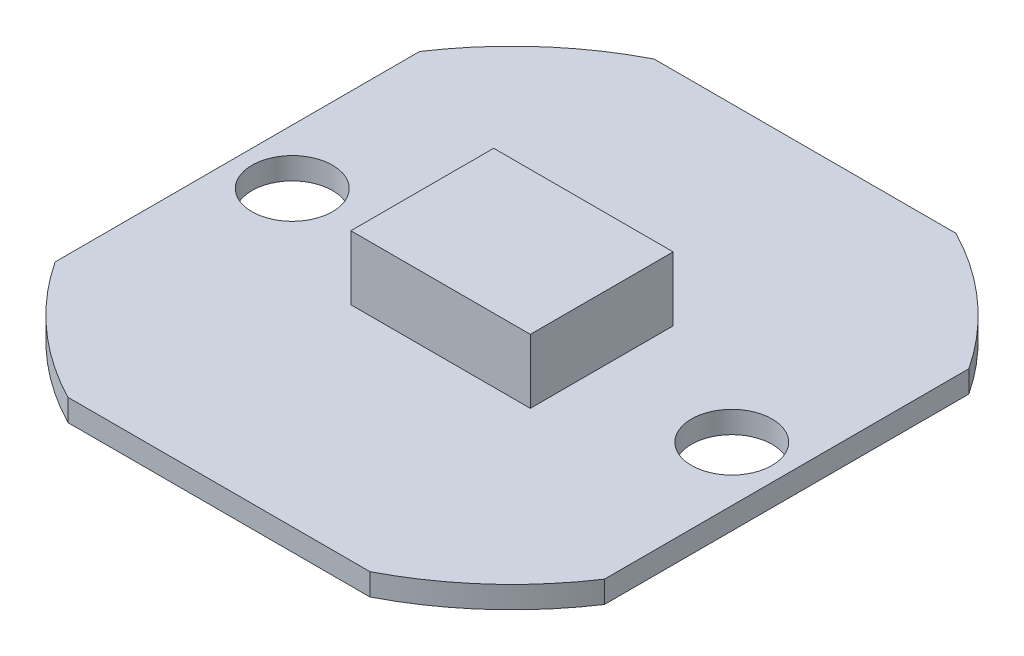
ISO-10303-21;
HEADER;
FILE_DESCRIPTION(('STEP AP214'),'2;1');
FILE_NAME('part.step','',(''),(''),'','','');
FILE_SCHEMA(('AUTOMOTIVE_DESIGN { 1 0 10303 214 1 1 1 1 }'));
ENDSEC;
DATA;
#1=APPLICATION_CONTEXT('core data for automotive mechanical design processes');
#2=APPLICATION_PROTOCOL_DEFINITION('international standard','automotive_design',2000,#1);
#3=PRODUCT_CONTEXT('',#1,'mechanical');
#4=PRODUCT('Part','Part','',(#3));
#5=PRODUCT_RELATED_PRODUCT_CATEGORY('part','',(#4));
#6=PRODUCT_DEFINITION_FORMATION('','',#4);
#7=PRODUCT_DEFINITION_CONTEXT('part definition',#1,'design');
#8=PRODUCT_DEFINITION('design','',#6,#7);
#9=PRODUCT_DEFINITION_SHAPE('','',#8);
#10=(LENGTH_UNIT() NAMED_UNIT(*) SI_UNIT(.MILLI.,.METRE.));
#11=(NAMED_UNIT(*) PLANE_ANGLE_UNIT() SI_UNIT($,.RADIAN.));
#12=(NAMED_UNIT(*) SI_UNIT($,.STERADIAN.) SOLID_ANGLE_UNIT());
#13=UNCERTAINTY_MEASURE_WITH_UNIT(LENGTH_MEASURE(1.E-05),#10,'distance_accuracy_value','');
#14=(GEOMETRIC_REPRESENTATION_CONTEXT(3) GLOBAL_UNCERTAINTY_ASSIGNED_CONTEXT((#13)) GLOBAL_UNIT_ASSIGNED_CONTEXT((#10,
#11,#12)) REPRESENTATION_CONTEXT('',''));
#15=CARTESIAN_POINT('',(0.,0.,0.));
#16=DIRECTION('',(0.,0.,1.));
#17=DIRECTION('',(1.,0.,0.));
#18=AXIS2_PLACEMENT_3D('',#15,#16,#17);
#19=CARTESIAN_POINT('',(0.,0.6,0.));
#20=DIRECTION('',(0.,-1.,0.));
#21=DIRECTION('',(0.,0.,-1.));
#22=AXIS2_PLACEMENT_3D('',#19,#20,#21);
#23=PLANE('',#22);
#24=CARTESIAN_POINT('',(6.,0.6,0.));
#25=DIRECTION('',(0.,1.,0.));
#26=DIRECTION('',(0.,0.,-1.));
#27=AXIS2_PLACEMENT_3D('',#24,#25,#26);
#28=CIRCLE('',#27,1.1);
#29=CARTESIAN_POINT('',(6.,0.6,-1.1));
#30=VERTEX_POINT('',#29);
#31=EDGE_CURVE('E157',#30,#30,#28,.T.);
#32=ORIENTED_EDGE('',*,*,#31,.F.);
#33=EDGE_LOOP('',(#32));
#34=FACE_BOUND('',#33,.T.);
#35=CARTESIAN_POINT('',(-6.,0.6,0.));
#36=DIRECTION('',(0.,1.,0.));
#37=DIRECTION('',(0.,0.,1.));
#38=AXIS2_PLACEMENT_3D('',#35,#36,#37);
#39=CIRCLE('',#38,1.1);
#40=CARTESIAN_POINT('',(-6.,0.6,1.1));
#41=VERTEX_POINT('',#40);
#42=EDGE_CURVE('E167',#41,#41,#39,.T.);
#43=ORIENTED_EDGE('',*,*,#42,.F.);
#44=EDGE_LOOP('',(#43));
#45=FACE_BOUND('',#44,.T.);
#46=CARTESIAN_POINT('',(0.,0.6,0.));
#47=DIRECTION('',(0.,1.,0.));
#48=DIRECTION('',(0.,0.,-1.));
#49=AXIS2_PLACEMENT_3D('',#46,#47,#48);
#50=CIRCLE('',#49,9.);
#51=CARTESIAN_POINT('',(-4.12310562561766,0.6,-8.));
#52=VERTEX_POINT('',#51);
#53=CARTESIAN_POINT('',(-7.5,0.6,-4.9749371855331));
#54=VERTEX_POINT('',#53);
#55=EDGE_CURVE('E175',#52,#54,#50,.T.);
#56=ORIENTED_EDGE('',*,*,#55,.T.);
#57=DIRECTION('',(0.,0.,1.));
#58=VECTOR('',#57,1.);
#59=CARTESIAN_POINT('',(-7.5,0.6,4.9749371855331));
#60=LINE('',#59,#58);
#61=CARTESIAN_POINT('',(-7.5,0.6,4.9749371855331));
#62=VERTEX_POINT('',#61);
#63=EDGE_CURVE('E179',#54,#62,#60,.T.);
#64=ORIENTED_EDGE('',*,*,#63,.T.);
#65=CARTESIAN_POINT('',(0.,0.6,0.));
#66=DIRECTION('',(0.,1.,0.));
#67=DIRECTION('',(0.,0.,1.));
#68=AXIS2_PLACEMENT_3D('',#65,#66,#67);
#69=CIRCLE('',#68,9.);
#70=CARTESIAN_POINT('',(-4.12310562561766,0.6,8.));
#71=VERTEX_POINT('',#70);
#72=EDGE_CURVE('E183',#62,#71,#69,.T.);
#73=ORIENTED_EDGE('',*,*,#72,.T.);
#74=DIRECTION('',(1.,0.,0.));
#75=VECTOR('',#74,1.);
#76=CARTESIAN_POINT('',(-4.12310562561766,0.6,8.));
#77=LINE('',#76,#75);
#78=CARTESIAN_POINT('',(4.12310562561766,0.6,8.));
#79=VERTEX_POINT('',#78);
#80=EDGE_CURVE('E186',#71,#79,#77,.T.);
#81=ORIENTED_EDGE('',*,*,#80,.T.);
#82=CARTESIAN_POINT('',(0.,0.6,0.));
#83=DIRECTION('',(0.,1.,0.));
#84=DIRECTION('',(0.,0.,-1.));
#85=AXIS2_PLACEMENT_3D('',#82,#83,#84);
#86=CIRCLE('',#85,9.);
#87=CARTESIAN_POINT('',(7.5,0.6,4.9749371855331));
#88=VERTEX_POINT('',#87);
#89=EDGE_CURVE('E189',#79,#88,#86,.T.);
#90=ORIENTED_EDGE('',*,*,#89,.T.);
#91=DIRECTION('',(0.,0.,-1.));
#92=VECTOR('',#91,1.);
#93=CARTESIAN_POINT('',(7.5,0.6,4.9749371855331));
#94=LINE('',#93,#92);
#95=CARTESIAN_POINT('',(7.5,0.6,-4.9749371855331));
#96=VERTEX_POINT('',#95);
#97=EDGE_CURVE('E192',#88,#96,#94,.T.);
#98=ORIENTED_EDGE('',*,*,#97,.T.);
#99=CARTESIAN_POINT('',(0.,0.6,0.));
#100=DIRECTION('',(0.,1.,0.));
#101=DIRECTION('',(0.,0.,1.));
#102=AXIS2_PLACEMENT_3D('',#99,#100,#101);
#103=CIRCLE('',#102,9.);
#104=CARTESIAN_POINT('',(4.12310562561766,0.6,-8.));
#105=VERTEX_POINT('',#104);
#106=EDGE_CURVE('E195',#96,#105,#103,.T.);
#107=ORIENTED_EDGE('',*,*,#106,.T.);
#108=DIRECTION('',(-1.,0.,0.));
#109=VECTOR('',#108,1.);
#110=CARTESIAN_POINT('',(-4.12310562561766,0.6,-8.));
#111=LINE('',#110,#109);
#112=EDGE_CURVE('E198',#105,#52,#111,.T.);
#113=ORIENTED_EDGE('',*,*,#112,.T.);
#114=EDGE_LOOP('',(#56,#64,#73,#81,#90,#98,#107,#113));
#115=FACE_BOUND('',#114,.T.);
#116=DIRECTION('',(0.,0.,1.));
#117=VECTOR('',#116,1.);
#118=CARTESIAN_POINT('',(-2.45,0.6,-1.95));
#119=LINE('',#118,#117);
#120=CARTESIAN_POINT('',(-2.45,0.6,-1.95));
#121=VERTEX_POINT('',#120);
#122=CARTESIAN_POINT('',(-2.45,0.6,1.95));
#123=VERTEX_POINT('',#122);
#124=EDGE_CURVE('E55',#121,#123,#119,.T.);
#125=ORIENTED_EDGE('',*,*,#124,.F.);
#126=DIRECTION('',(-1.,0.,0.));
#127=VECTOR('',#126,1.);
#128=CARTESIAN_POINT('',(2.45,0.6,-1.95));
#129=LINE('',#128,#127);
#130=CARTESIAN_POINT('',(2.45,0.6,-1.95));
#131=VERTEX_POINT('',#130);
#132=EDGE_CURVE('E59',#131,#121,#129,.T.);
#133=ORIENTED_EDGE('',*,*,#132,.F.);
#134=DIRECTION('',(0.,0.,-1.));
#135=VECTOR('',#134,1.);
#136=CARTESIAN_POINT('',(2.45,0.6,-1.95));
#137=LINE('',#136,#135);
#138=CARTESIAN_POINT('',(2.45,0.6,1.95));
#139=VERTEX_POINT('',#138);
#140=EDGE_CURVE('E444',#139,#131,#137,.T.);
#141=ORIENTED_EDGE('',*,*,#140,.F.);
#142=DIRECTION('',(1.,0.,0.));
#143=VECTOR('',#142,1.);
#144=CARTESIAN_POINT('',(-2.45,0.6,1.95));
#145=LINE('',#144,#143);
#146=EDGE_CURVE('E454',#123,#139,#145,.T.);
#147=ORIENTED_EDGE('',*,*,#146,.F.);
#148=EDGE_LOOP('',(#125,#133,#141,#147));
#149=FACE_BOUND('',#148,.T.);
#150=ADVANCED_FACE('F39',(#34,#45,#115,#149),#23,.F.);
#151=CARTESIAN_POINT('',(0.,0.,0.));
#152=DIRECTION('',(0.,-1.,0.));
#153=DIRECTION('',(0.,0.,-1.));
#154=AXIS2_PLACEMENT_3D('',#151,#152,#153);
#155=PLANE('',#154);
#156=CARTESIAN_POINT('',(-6.,0.,0.));
#157=DIRECTION('',(0.,1.,0.));
#158=DIRECTION('',(0.,0.,1.));
#159=AXIS2_PLACEMENT_3D('',#156,#157,#158);
#160=CIRCLE('',#159,1.1);
#161=CARTESIAN_POINT('',(-6.,0.,1.1));
#162=VERTEX_POINT('',#161);
#163=EDGE_CURVE('E165',#162,#162,#160,.T.);
#164=ORIENTED_EDGE('',*,*,#163,.T.);
#165=EDGE_LOOP('',(#164));
#166=FACE_BOUND('',#165,.T.);
#167=CARTESIAN_POINT('',(0.,0.,0.));
#168=DIRECTION('',(0.,1.,0.));
#169=DIRECTION('',(0.,0.,-1.));
#170=AXIS2_PLACEMENT_3D('',#167,#168,#169);
#171=CIRCLE('',#170,9.);
#172=CARTESIAN_POINT('',(-4.12310562561766,0.,-8.));
#173=VERTEX_POINT('',#172);
#174=CARTESIAN_POINT('',(-7.5,0.,-4.9749371855331));
#175=VERTEX_POINT('',#174);
#176=EDGE_CURVE('E171',#173,#175,#171,.T.);
#177=ORIENTED_EDGE('',*,*,#176,.F.);
#178=DIRECTION('',(-1.,0.,0.));
#179=VECTOR('',#178,1.);
#180=CARTESIAN_POINT('',(-4.12310562561766,0.,-8.));
#181=LINE('',#180,#179);
#182=CARTESIAN_POINT('',(4.12310562561766,0.,-8.));
#183=VERTEX_POINT('',#182);
#184=EDGE_CURVE('E180',#183,#173,#181,.T.);
#185=ORIENTED_EDGE('',*,*,#184,.F.);
#186=CARTESIAN_POINT('',(0.,0.,0.));
#187=DIRECTION('',(0.,1.,0.));
#188=DIRECTION('',(0.,0.,1.));
#189=AXIS2_PLACEMENT_3D('',#186,#187,#188);
#190=CIRCLE('',#189,9.);
#191=CARTESIAN_POINT('',(7.5,0.,-4.9749371855331));
#192=VERTEX_POINT('',#191);
#193=EDGE_CURVE('E220',#192,#183,#190,.T.);
#194=ORIENTED_EDGE('',*,*,#193,.F.);
#195=DIRECTION('',(0.,0.,-1.));
#196=VECTOR('',#195,1.);
#197=CARTESIAN_POINT('',(7.5,0.,4.9749371855331));
#198=LINE('',#197,#196);
#199=CARTESIAN_POINT('',(7.5,0.,4.9749371855331));
#200=VERTEX_POINT('',#199);
#201=EDGE_CURVE('E217',#200,#192,#198,.T.);
#202=ORIENTED_EDGE('',*,*,#201,.F.);
#203=CARTESIAN_POINT('',(0.,0.,0.));
#204=DIRECTION('',(0.,1.,0.));
#205=DIRECTION('',(0.,0.,-1.));
#206=AXIS2_PLACEMENT_3D('',#203,#204,#205);
#207=CIRCLE('',#206,9.);
#208=CARTESIAN_POINT('',(4.12310562561766,0.,8.));
#209=VERTEX_POINT('',#208);
#210=EDGE_CURVE('E214',#209,#200,#207,.T.);
#211=ORIENTED_EDGE('',*,*,#210,.F.);
#212=DIRECTION('',(1.,0.,0.));
#213=VECTOR('',#212,1.);
#214=CARTESIAN_POINT('',(-4.12310562561766,0.,8.));
#215=LINE('',#214,#213);
#216=CARTESIAN_POINT('',(-4.12310562561766,0.,8.));
#217=VERTEX_POINT('',#216);
#218=EDGE_CURVE('E211',#217,#209,#215,.T.);
#219=ORIENTED_EDGE('',*,*,#218,.F.);
#220=CARTESIAN_POINT('',(0.,0.,0.));
#221=DIRECTION('',(0.,1.,0.));
#222=DIRECTION('',(0.,0.,1.));
#223=AXIS2_PLACEMENT_3D('',#220,#221,#222);
#224=CIRCLE('',#223,9.);
#225=CARTESIAN_POINT('',(-7.5,0.,4.9749371855331));
#226=VERTEX_POINT('',#225);
#227=EDGE_CURVE('E208',#226,#217,#224,.T.);
#228=ORIENTED_EDGE('',*,*,#227,.F.);
#229=DIRECTION('',(0.,0.,1.));
#230=VECTOR('',#229,1.);
#231=CARTESIAN_POINT('',(-7.5,0.,4.9749371855331));
#232=LINE('',#231,#230);
#233=EDGE_CURVE('E205',#175,#226,#232,.T.);
#234=ORIENTED_EDGE('',*,*,#233,.F.);
#235=EDGE_LOOP('',(#177,#185,#194,#202,#211,#219,#228,#234));
#236=FACE_BOUND('',#235,.T.);
#237=CARTESIAN_POINT('',(6.,0.,0.));
#238=DIRECTION('',(0.,1.,0.));
#239=DIRECTION('',(0.,0.,-1.));
#240=AXIS2_PLACEMENT_3D('',#237,#238,#239);
#241=CIRCLE('',#240,1.1);
#242=CARTESIAN_POINT('',(6.,0.,-1.1));
#243=VERTEX_POINT('',#242);
#244=EDGE_CURVE('E152',#243,#243,#241,.T.);
#245=ORIENTED_EDGE('',*,*,#244,.T.);
#246=EDGE_LOOP('',(#245));
#247=FACE_BOUND('',#246,.T.);
#248=ADVANCED_FACE('F259',(#166,#236,#247),#155,.T.);
#249=CARTESIAN_POINT('',(0.,0.6,0.));
#250=DIRECTION('',(0.,-1.,0.));
#251=DIRECTION('',(0.,0.,-1.));
#252=AXIS2_PLACEMENT_3D('',#249,#250,#251);
#253=CYLINDRICAL_SURFACE('',#252,9.);
#254=ORIENTED_EDGE('',*,*,#176,.T.);
#255=DIRECTION('',(0.,-1.,0.));
#256=VECTOR('',#255,1.);
#257=CARTESIAN_POINT('',(-7.5,0.6,-4.9749371855331));
#258=LINE('',#257,#256);
#259=EDGE_CURVE('E11',#54,#175,#258,.T.);
#260=ORIENTED_EDGE('',*,*,#259,.F.);
#261=ORIENTED_EDGE('',*,*,#55,.F.);
#262=DIRECTION('',(0.,-1.,0.));
#263=VECTOR('',#262,1.);
#264=CARTESIAN_POINT('',(-4.12310562561766,0.6,-8.));
#265=LINE('',#264,#263);
#266=EDGE_CURVE('E201',#52,#173,#265,.T.);
#267=ORIENTED_EDGE('',*,*,#266,.T.);
#268=EDGE_LOOP('',(#254,#260,#261,#267));
#269=FACE_BOUND('',#268,.T.);
#270=ADVANCED_FACE('F41',(#269),#253,.T.);
#271=CARTESIAN_POINT('',(-7.5,0.6,4.9749371855331));
#272=DIRECTION('',(1.,0.,0.));
#273=DIRECTION('',(0.,0.,-1.));
#274=AXIS2_PLACEMENT_3D('',#271,#272,#273);
#275=PLANE('',#274);
#276=ORIENTED_EDGE('',*,*,#233,.T.);
#277=DIRECTION('',(0.,-1.,0.));
#278=VECTOR('',#277,1.);
#279=CARTESIAN_POINT('',(-7.5,0.6,4.9749371855331));
#280=LINE('',#279,#278);
#281=EDGE_CURVE('E48',#62,#226,#280,.T.);
#282=ORIENTED_EDGE('',*,*,#281,.F.);
#283=ORIENTED_EDGE('',*,*,#63,.F.);
#284=ORIENTED_EDGE('',*,*,#259,.T.);
#285=EDGE_LOOP('',(#276,#282,#283,#284));
#286=FACE_BOUND('',#285,.T.);
#287=ADVANCED_FACE('F276',(#286),#275,.F.);
#288=CARTESIAN_POINT('',(0.,0.6,0.));
#289=DIRECTION('',(0.,-1.,0.));
#290=DIRECTION('',(0.,0.,-1.));
#291=AXIS2_PLACEMENT_3D('',#288,#289,#290);
#292=CYLINDRICAL_SURFACE('',#291,9.);
#293=ORIENTED_EDGE('',*,*,#227,.T.);
#294=DIRECTION('',(0.,-1.,0.));
#295=VECTOR('',#294,1.);
#296=CARTESIAN_POINT('',(-4.12310562561766,0.6,8.));
#297=LINE('',#296,#295);
#298=EDGE_CURVE('E244',#71,#217,#297,.T.);
#299=ORIENTED_EDGE('',*,*,#298,.F.);
#300=ORIENTED_EDGE('',*,*,#72,.F.);
#301=ORIENTED_EDGE('',*,*,#281,.T.);
#302=EDGE_LOOP('',(#293,#299,#300,#301));
#303=FACE_BOUND('',#302,.T.);
#304=ADVANCED_FACE('F253',(#303),#292,.T.);
#305=CARTESIAN_POINT('',(-4.12310562561766,0.6,8.));
#306=DIRECTION('',(0.,0.,-1.));
#307=DIRECTION('',(-1.,0.,0.));
#308=AXIS2_PLACEMENT_3D('',#305,#306,#307);
#309=PLANE('',#308);
#310=ORIENTED_EDGE('',*,*,#218,.T.);
#311=DIRECTION('',(0.,-1.,0.));
#312=VECTOR('',#311,1.);
#313=CARTESIAN_POINT('',(4.12310562561766,0.6,8.));
#314=LINE('',#313,#312);
#315=EDGE_CURVE('E240',#79,#209,#314,.T.);
#316=ORIENTED_EDGE('',*,*,#315,.F.);
#317=ORIENTED_EDGE('',*,*,#80,.F.);
#318=ORIENTED_EDGE('',*,*,#298,.T.);
#319=EDGE_LOOP('',(#310,#316,#317,#318));
#320=FACE_BOUND('',#319,.T.);
#321=ADVANCED_FACE('F265',(#320),#309,.F.);
#322=CARTESIAN_POINT('',(0.,0.6,0.));
#323=DIRECTION('',(0.,-1.,0.));
#324=DIRECTION('',(0.,0.,-1.));
#325=AXIS2_PLACEMENT_3D('',#322,#323,#324);
#326=CYLINDRICAL_SURFACE('',#325,9.);
#327=ORIENTED_EDGE('',*,*,#210,.T.);
#328=DIRECTION('',(0.,-1.,0.));
#329=VECTOR('',#328,1.);
#330=CARTESIAN_POINT('',(7.5,0.6,4.9749371855331));
#331=LINE('',#330,#329);
#332=EDGE_CURVE('E236',#88,#200,#331,.T.);
#333=ORIENTED_EDGE('',*,*,#332,.F.);
#334=ORIENTED_EDGE('',*,*,#89,.F.);
#335=ORIENTED_EDGE('',*,*,#315,.T.);
#336=EDGE_LOOP('',(#327,#333,#334,#335));
#337=FACE_BOUND('',#336,.T.);
#338=ADVANCED_FACE('F269',(#337),#326,.T.);
#339=CARTESIAN_POINT('',(7.5,0.6,4.9749371855331));
#340=DIRECTION('',(-1.,0.,0.));
#341=DIRECTION('',(0.,0.,1.));
#342=AXIS2_PLACEMENT_3D('',#339,#340,#341);
#343=PLANE('',#342);
#344=ORIENTED_EDGE('',*,*,#201,.T.);
#345=DIRECTION('',(0.,-1.,0.));
#346=VECTOR('',#345,1.);
#347=CARTESIAN_POINT('',(7.5,0.6,-4.9749371855331));
#348=LINE('',#347,#346);
#349=EDGE_CURVE('E232',#96,#192,#348,.T.);
#350=ORIENTED_EDGE('',*,*,#349,.F.);
#351=ORIENTED_EDGE('',*,*,#97,.F.);
#352=ORIENTED_EDGE('',*,*,#332,.T.);
#353=EDGE_LOOP('',(#344,#350,#351,#352));
#354=FACE_BOUND('',#353,.T.);
#355=ADVANCED_FACE('F289',(#354),#343,.F.);
#356=CARTESIAN_POINT('',(0.,0.6,0.));
#357=DIRECTION('',(0.,-1.,0.));
#358=DIRECTION('',(0.,0.,-1.));
#359=AXIS2_PLACEMENT_3D('',#356,#357,#358);
#360=CYLINDRICAL_SURFACE('',#359,9.);
#361=ORIENTED_EDGE('',*,*,#193,.T.);
#362=DIRECTION('',(0.,-1.,0.));
#363=VECTOR('',#362,1.);
#364=CARTESIAN_POINT('',(4.12310562561766,0.6,-8.));
#365=LINE('',#364,#363);
#366=EDGE_CURVE('E228',#105,#183,#365,.T.);
#367=ORIENTED_EDGE('',*,*,#366,.F.);
#368=ORIENTED_EDGE('',*,*,#106,.F.);
#369=ORIENTED_EDGE('',*,*,#349,.T.);
#370=EDGE_LOOP('',(#361,#367,#368,#369));
#371=FACE_BOUND('',#370,.T.);
#372=ADVANCED_FACE('F287',(#371),#360,.T.);
#373=CARTESIAN_POINT('',(-4.12310562561766,0.6,-8.));
#374=DIRECTION('',(0.,0.,1.));
#375=DIRECTION('',(1.,0.,0.));
#376=AXIS2_PLACEMENT_3D('',#373,#374,#375);
#377=PLANE('',#376);
#378=ORIENTED_EDGE('',*,*,#184,.T.);
#379=ORIENTED_EDGE('',*,*,#266,.F.);
#380=ORIENTED_EDGE('',*,*,#112,.F.);
#381=ORIENTED_EDGE('',*,*,#366,.T.);
#382=EDGE_LOOP('',(#378,#379,#380,#381));
#383=FACE_BOUND('',#382,.T.);
#384=ADVANCED_FACE('F282',(#383),#377,.F.);
#385=CARTESIAN_POINT('',(-6.,0.6,0.));
#386=DIRECTION('',(0.,-1.,0.));
#387=DIRECTION('',(0.,0.,-1.));
#388=AXIS2_PLACEMENT_3D('',#385,#386,#387);
#389=CYLINDRICAL_SURFACE('',#388,1.1);
#390=ORIENTED_EDGE('',*,*,#42,.T.);
#391=EDGE_LOOP('',(#390));
#392=FACE_BOUND('',#391,.T.);
#393=ORIENTED_EDGE('',*,*,#163,.F.);
#394=EDGE_LOOP('',(#393));
#395=FACE_BOUND('',#394,.T.);
#396=ADVANCED_FACE('F309',(#392,#395),#389,.F.);
#397=CARTESIAN_POINT('',(6.,0.6,0.));
#398=DIRECTION('',(0.,-1.,0.));
#399=DIRECTION('',(0.,0.,-1.));
#400=AXIS2_PLACEMENT_3D('',#397,#398,#399);
#401=CYLINDRICAL_SURFACE('',#400,1.1);
#402=ORIENTED_EDGE('',*,*,#31,.T.);
#403=EDGE_LOOP('',(#402));
#404=FACE_BOUND('',#403,.T.);
#405=ORIENTED_EDGE('',*,*,#244,.F.);
#406=EDGE_LOOP('',(#405));
#407=FACE_BOUND('',#406,.T.);
#408=ADVANCED_FACE('F316',(#404,#407),#401,.F.);
#409=CARTESIAN_POINT('',(-2.45,2.35,-1.95));
#410=DIRECTION('',(1.,0.,0.));
#411=DIRECTION('',(0.,0.,-1.));
#412=AXIS2_PLACEMENT_3D('',#409,#410,#411);
#413=PLANE('',#412);
#414=ORIENTED_EDGE('',*,*,#124,.T.);
#415=DIRECTION('',(0.,-1.,0.));
#416=VECTOR('',#415,1.);
#417=CARTESIAN_POINT('',(-2.45,2.35,1.95));
#418=LINE('',#417,#416);
#419=CARTESIAN_POINT('',(-2.45,2.35,1.95));
#420=VERTEX_POINT('',#419);
#421=EDGE_CURVE('E132',#420,#123,#418,.T.);
#422=ORIENTED_EDGE('',*,*,#421,.F.);
#423=DIRECTION('',(0.,0.,1.));
#424=VECTOR('',#423,1.);
#425=CARTESIAN_POINT('',(-2.45,2.35,-1.95));
#426=LINE('',#425,#424);
#427=CARTESIAN_POINT('',(-2.45,2.35,-1.95));
#428=VERTEX_POINT('',#427);
#429=EDGE_CURVE('E139',#428,#420,#426,.T.);
#430=ORIENTED_EDGE('',*,*,#429,.F.);
#431=DIRECTION('',(0.,-1.,0.));
#432=VECTOR('',#431,1.);
#433=CARTESIAN_POINT('',(-2.45,2.35,-1.95));
#434=LINE('',#433,#432);
#435=EDGE_CURVE('E441',#428,#121,#434,.T.);
#436=ORIENTED_EDGE('',*,*,#435,.T.);
#437=EDGE_LOOP('',(#414,#422,#430,#436));
#438=FACE_BOUND('',#437,.T.);
#439=ADVANCED_FACE('F150',(#438),#413,.F.);
#440=CARTESIAN_POINT('',(-2.45,2.35,1.95));
#441=DIRECTION('',(0.,0.,-1.));
#442=DIRECTION('',(-1.,0.,0.));
#443=AXIS2_PLACEMENT_3D('',#440,#441,#442);
#444=PLANE('',#443);
#445=ORIENTED_EDGE('',*,*,#146,.T.);
#446=DIRECTION('',(0.,-1.,0.));
#447=VECTOR('',#446,1.);
#448=CARTESIAN_POINT('',(2.45,2.35,1.95));
#449=LINE('',#448,#447);
#450=CARTESIAN_POINT('',(2.45,2.35,1.95));
#451=VERTEX_POINT('',#450);
#452=EDGE_CURVE('E134',#451,#139,#449,.T.);
#453=ORIENTED_EDGE('',*,*,#452,.F.);
#454=DIRECTION('',(1.,0.,0.));
#455=VECTOR('',#454,1.);
#456=CARTESIAN_POINT('',(-2.45,2.35,1.95));
#457=LINE('',#456,#455);
#458=EDGE_CURVE('E127',#420,#451,#457,.T.);
#459=ORIENTED_EDGE('',*,*,#458,.F.);
#460=ORIENTED_EDGE('',*,*,#421,.T.);
#461=EDGE_LOOP('',(#445,#453,#459,#460));
#462=FACE_BOUND('',#461,.T.);
#463=ADVANCED_FACE('F130',(#462),#444,.F.);
#464=CARTESIAN_POINT('',(2.45,2.35,-1.95));
#465=DIRECTION('',(-1.,0.,0.));
#466=DIRECTION('',(0.,0.,1.));
#467=AXIS2_PLACEMENT_3D('',#464,#465,#466);
#468=PLANE('',#467);
#469=ORIENTED_EDGE('',*,*,#140,.T.);
#470=DIRECTION('',(0.,-1.,0.));
#471=VECTOR('',#470,1.);
#472=CARTESIAN_POINT('',(2.45,2.35,-1.95));
#473=LINE('',#472,#471);
#474=CARTESIAN_POINT('',(2.45,2.35,-1.95));
#475=VERTEX_POINT('',#474);
#476=EDGE_CURVE('E159',#475,#131,#473,.T.);
#477=ORIENTED_EDGE('',*,*,#476,.F.);
#478=DIRECTION('',(0.,0.,-1.));
#479=VECTOR('',#478,1.);
#480=CARTESIAN_POINT('',(2.45,2.35,-1.95));
#481=LINE('',#480,#479);
#482=EDGE_CURVE('E138',#451,#475,#481,.T.);
#483=ORIENTED_EDGE('',*,*,#482,.F.);
#484=ORIENTED_EDGE('',*,*,#452,.T.);
#485=EDGE_LOOP('',(#469,#477,#483,#484));
#486=FACE_BOUND('',#485,.T.);
#487=ADVANCED_FACE('F333',(#486),#468,.F.);
#488=CARTESIAN_POINT('',(2.45,2.35,-1.95));
#489=DIRECTION('',(0.,0.,1.));
#490=DIRECTION('',(1.,0.,0.));
#491=AXIS2_PLACEMENT_3D('',#488,#489,#490);
#492=PLANE('',#491);
#493=ORIENTED_EDGE('',*,*,#132,.T.);
#494=ORIENTED_EDGE('',*,*,#435,.F.);
#495=DIRECTION('',(-1.,0.,0.));
#496=VECTOR('',#495,1.);
#497=CARTESIAN_POINT('',(2.45,2.35,-1.95));
#498=LINE('',#497,#496);
#499=EDGE_CURVE('E144',#475,#428,#498,.T.);
#500=ORIENTED_EDGE('',*,*,#499,.F.);
#501=ORIENTED_EDGE('',*,*,#476,.T.);
#502=EDGE_LOOP('',(#493,#494,#500,#501));
#503=FACE_BOUND('',#502,.T.);
#504=ADVANCED_FACE('F336',(#503),#492,.F.);
#505=CARTESIAN_POINT('',(0.,2.35,0.));
#506=DIRECTION('',(0.,1.,0.));
#507=DIRECTION('',(0.,0.,1.));
#508=AXIS2_PLACEMENT_3D('',#505,#506,#507);
#509=PLANE('',#508);
#510=ORIENTED_EDGE('',*,*,#429,.T.);
#511=ORIENTED_EDGE('',*,*,#458,.T.);
#512=ORIENTED_EDGE('',*,*,#482,.T.);
#513=ORIENTED_EDGE('',*,*,#499,.T.);
#514=EDGE_LOOP('',(#510,#511,#512,#513));
#515=FACE_BOUND('',#514,.T.);
#516=ADVANCED_FACE('F142',(#515),#509,.T.);
#517=CLOSED_SHELL('',(#150,#248,#270,#287,#304,#321,#338,#355,#372,#384,#396,#408,#439,#463,
#487,#504,#516));
#518=MANIFOLD_SOLID_BREP('B2',#517);
#519=ADVANCED_BREP_SHAPE_REPRESENTATION('',(#18,#518),#14);
#520=SHAPE_DEFINITION_REPRESENTATION(#9,#519);
ENDSEC;
END-ISO-10303-21;
